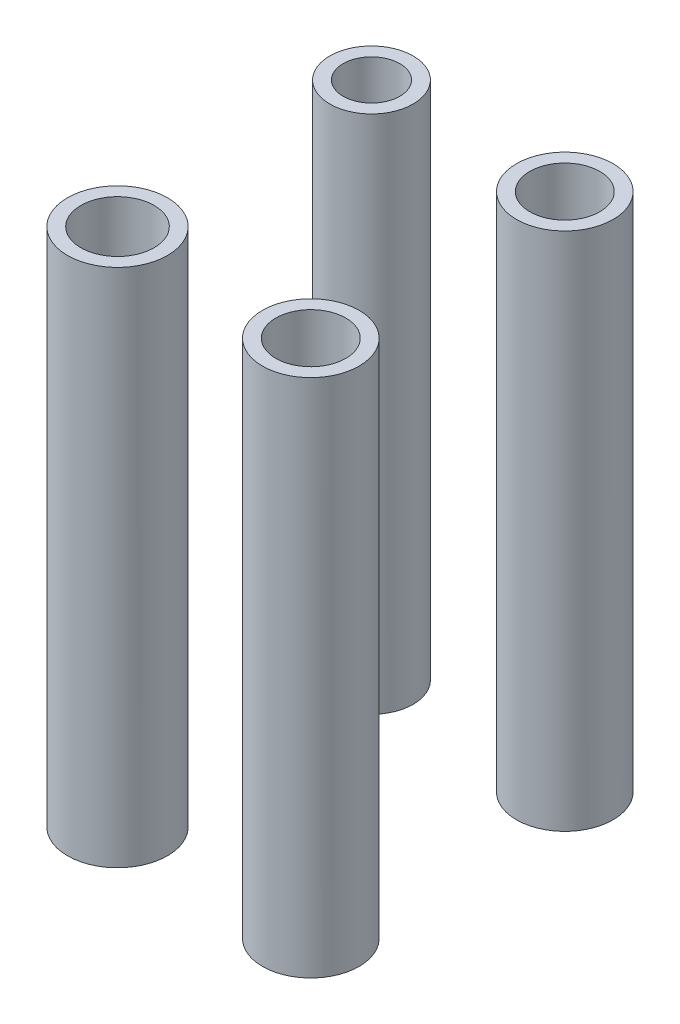
ISO-10303-21;
HEADER;
FILE_DESCRIPTION(('STEP AP214'),'2;1');
FILE_NAME('part.step','',(''),(''),'','','');
FILE_SCHEMA(('AUTOMOTIVE_DESIGN { 1 0 10303 214 1 1 1 1 }'));
ENDSEC;
DATA;
#1=APPLICATION_CONTEXT('core data for automotive mechanical design processes');
#2=APPLICATION_PROTOCOL_DEFINITION('international standard','automotive_design',2000,#1);
#3=PRODUCT_CONTEXT('',#1,'mechanical');
#4=PRODUCT('Part','Part','',(#3));
#5=PRODUCT_RELATED_PRODUCT_CATEGORY('part','',(#4));
#6=PRODUCT_DEFINITION_FORMATION('','',#4);
#7=PRODUCT_DEFINITION_CONTEXT('part definition',#1,'design');
#8=PRODUCT_DEFINITION('design','',#6,#7);
#9=PRODUCT_DEFINITION_SHAPE('','',#8);
#10=(LENGTH_UNIT() NAMED_UNIT(*) SI_UNIT(.MILLI.,.METRE.));
#11=(NAMED_UNIT(*) PLANE_ANGLE_UNIT() SI_UNIT($,.RADIAN.));
#12=(NAMED_UNIT(*) SI_UNIT($,.STERADIAN.) SOLID_ANGLE_UNIT());
#13=UNCERTAINTY_MEASURE_WITH_UNIT(LENGTH_MEASURE(1.E-05),#10,'distance_accuracy_value','');
#14=(GEOMETRIC_REPRESENTATION_CONTEXT(3) GLOBAL_UNCERTAINTY_ASSIGNED_CONTEXT((#13)) GLOBAL_UNIT_ASSIGNED_CONTEXT((#10,
#11,#12)) REPRESENTATION_CONTEXT('',''));
#15=CARTESIAN_POINT('',(0.,0.,0.));
#16=DIRECTION('',(0.,0.,1.));
#17=DIRECTION('',(1.,0.,0.));
#18=AXIS2_PLACEMENT_3D('',#15,#16,#17);
#19=CARTESIAN_POINT('',(-14.5,2.,-17.));
#20=DIRECTION('',(0.,-1.,0.));
#21=DIRECTION('',(0.,0.,-1.));
#22=AXIS2_PLACEMENT_3D('',#19,#20,#21);
#23=CYLINDRICAL_SURFACE('',#22,4.25);
#24=CARTESIAN_POINT('',(-14.5,0.,-17.));
#25=DIRECTION('',(0.,-1.,0.));
#26=DIRECTION('',(0.,0.,-1.));
#27=AXIS2_PLACEMENT_3D('',#24,#25,#26);
#28=CIRCLE('',#27,4.25);
#29=CARTESIAN_POINT('',(-14.5,0.,-21.25));
#30=VERTEX_POINT('',#29);
#31=EDGE_CURVE('E47',#30,#30,#28,.T.);
#32=ORIENTED_EDGE('',*,*,#31,.F.);
#33=EDGE_LOOP('',(#32));
#34=FACE_BOUND('',#33,.T.);
#35=CARTESIAN_POINT('',(-14.5,-78.,-17.));
#36=DIRECTION('',(0.,1.,0.));
#37=DIRECTION('',(0.,0.,1.));
#38=AXIS2_PLACEMENT_3D('',#35,#36,#37);
#39=CIRCLE('',#38,4.25);
#40=CARTESIAN_POINT('',(-14.5,-78.,-12.75));
#41=VERTEX_POINT('',#40);
#42=EDGE_CURVE('E51',#41,#41,#39,.T.);
#43=ORIENTED_EDGE('',*,*,#42,.F.);
#44=EDGE_LOOP('',(#43));
#45=FACE_BOUND('',#44,.T.);
#46=ADVANCED_FACE('F40',(#34,#45),#23,.F.);
#47=CARTESIAN_POINT('',(-14.5,-78.,-17.));
#48=DIRECTION('',(0.,1.,0.));
#49=DIRECTION('',(0.,0.,1.));
#50=AXIS2_PLACEMENT_3D('',#47,#48,#49);
#51=CYLINDRICAL_SURFACE('',#50,6.25);
#52=CARTESIAN_POINT('',(-14.5,-78.,-17.));
#53=DIRECTION('',(0.,1.,0.));
#54=DIRECTION('',(0.,0.,1.));
#55=AXIS2_PLACEMENT_3D('',#52,#53,#54);
#56=CIRCLE('',#55,6.25);
#57=CARTESIAN_POINT('',(-14.5,-78.,-10.75));
#58=VERTEX_POINT('',#57);
#59=EDGE_CURVE('E55',#58,#58,#56,.T.);
#60=ORIENTED_EDGE('',*,*,#59,.T.);
#61=EDGE_LOOP('',(#60));
#62=FACE_BOUND('',#61,.T.);
#63=CARTESIAN_POINT('',(-14.5,0.,-17.));
#64=DIRECTION('',(0.,-1.,0.));
#65=DIRECTION('',(0.,0.,-1.));
#66=AXIS2_PLACEMENT_3D('',#63,#64,#65);
#67=CIRCLE('',#66,6.25);
#68=CARTESIAN_POINT('',(-14.5,0.,-23.25));
#69=VERTEX_POINT('',#68);
#70=EDGE_CURVE('E11',#69,#69,#67,.F.);
#71=ORIENTED_EDGE('',*,*,#70,.F.);
#72=EDGE_LOOP('',(#71));
#73=FACE_BOUND('',#72,.T.);
#74=ADVANCED_FACE('F61',(#62,#73),#51,.T.);
#75=CARTESIAN_POINT('',(-14.5,-78.,-17.));
#76=DIRECTION('',(0.,1.,0.));
#77=DIRECTION('',(0.,0.,1.));
#78=AXIS2_PLACEMENT_3D('',#75,#76,#77);
#79=PLANE('',#78);
#80=ORIENTED_EDGE('',*,*,#42,.T.);
#81=EDGE_LOOP('',(#80));
#82=FACE_BOUND('',#81,.T.);
#83=ORIENTED_EDGE('',*,*,#59,.F.);
#84=EDGE_LOOP('',(#83));
#85=FACE_BOUND('',#84,.T.);
#86=ADVANCED_FACE('F64',(#82,#85),#79,.F.);
#87=CARTESIAN_POINT('',(24.5,0.,41.));
#88=DIRECTION('',(0.,-1.,0.));
#89=DIRECTION('',(0.,0.,-1.));
#90=AXIS2_PLACEMENT_3D('',#87,#88,#89);
#91=PLANE('',#90);
#92=ORIENTED_EDGE('',*,*,#31,.T.);
#93=EDGE_LOOP('',(#92));
#94=FACE_BOUND('',#93,.T.);
#95=ORIENTED_EDGE('',*,*,#70,.T.);
#96=EDGE_LOOP('',(#95));
#97=FACE_BOUND('',#96,.T.);
#98=ADVANCED_FACE('F42',(#94,#97),#91,.F.);
#99=CLOSED_SHELL('',(#46,#74,#86,#98));
#100=MANIFOLD_SOLID_BREP('B2',#99);
#101=CARTESIAN_POINT('',(14.5,2.,21.1));
#102=DIRECTION('',(0.,-1.,0.));
#103=DIRECTION('',(0.,0.,-1.));
#104=AXIS2_PLACEMENT_3D('',#101,#102,#103);
#105=CYLINDRICAL_SURFACE('',#104,5.25);
#106=CARTESIAN_POINT('',(14.5,0.,21.1));
#107=DIRECTION('',(0.,-1.,0.));
#108=DIRECTION('',(0.,0.,-1.));
#109=AXIS2_PLACEMENT_3D('',#106,#107,#108);
#110=CIRCLE('',#109,5.25);
#111=CARTESIAN_POINT('',(14.5,0.,15.85));
#112=VERTEX_POINT('',#111);
#113=EDGE_CURVE('E120',#112,#112,#110,.T.);
#114=ORIENTED_EDGE('',*,*,#113,.F.);
#115=EDGE_LOOP('',(#114));
#116=FACE_BOUND('',#115,.T.);
#117=CARTESIAN_POINT('',(14.5,-78.,21.1));
#118=DIRECTION('',(0.,1.,0.));
#119=DIRECTION('',(0.,0.,1.));
#120=AXIS2_PLACEMENT_3D('',#117,#118,#119);
#121=CIRCLE('',#120,5.25);
#122=CARTESIAN_POINT('',(14.5,-78.,26.35));
#123=VERTEX_POINT('',#122);
#124=EDGE_CURVE('E128',#123,#123,#121,.T.);
#125=ORIENTED_EDGE('',*,*,#124,.F.);
#126=EDGE_LOOP('',(#125));
#127=FACE_BOUND('',#126,.T.);
#128=ADVANCED_FACE('F113',(#116,#127),#105,.F.);
#129=CARTESIAN_POINT('',(14.5,-78.,21.1));
#130=DIRECTION('',(0.,1.,0.));
#131=DIRECTION('',(0.,0.,1.));
#132=AXIS2_PLACEMENT_3D('',#129,#130,#131);
#133=PLANE('',#132);
#134=ORIENTED_EDGE('',*,*,#124,.T.);
#135=EDGE_LOOP('',(#134));
#136=FACE_BOUND('',#135,.T.);
#137=CARTESIAN_POINT('',(14.5,-78.,21.1));
#138=DIRECTION('',(0.,1.,0.));
#139=DIRECTION('',(0.,0.,1.));
#140=AXIS2_PLACEMENT_3D('',#137,#138,#139);
#141=CIRCLE('',#140,7.25);
#142=CARTESIAN_POINT('',(14.5,-78.,28.35));
#143=VERTEX_POINT('',#142);
#144=EDGE_CURVE('E124',#143,#143,#141,.T.);
#145=ORIENTED_EDGE('',*,*,#144,.F.);
#146=EDGE_LOOP('',(#145));
#147=FACE_BOUND('',#146,.T.);
#148=ADVANCED_FACE('F134',(#136,#147),#133,.F.);
#149=CARTESIAN_POINT('',(14.5,-78.,21.1));
#150=DIRECTION('',(0.,1.,0.));
#151=DIRECTION('',(0.,0.,1.));
#152=AXIS2_PLACEMENT_3D('',#149,#150,#151);
#153=CYLINDRICAL_SURFACE('',#152,7.25);
#154=ORIENTED_EDGE('',*,*,#144,.T.);
#155=EDGE_LOOP('',(#154));
#156=FACE_BOUND('',#155,.T.);
#157=CARTESIAN_POINT('',(14.5,0.,21.1));
#158=DIRECTION('',(0.,-1.,0.));
#159=DIRECTION('',(0.,0.,-1.));
#160=AXIS2_PLACEMENT_3D('',#157,#158,#159);
#161=CIRCLE('',#160,7.25);
#162=CARTESIAN_POINT('',(14.5,0.,13.85));
#163=VERTEX_POINT('',#162);
#164=EDGE_CURVE('E39',#163,#163,#161,.F.);
#165=ORIENTED_EDGE('',*,*,#164,.F.);
#166=EDGE_LOOP('',(#165));
#167=FACE_BOUND('',#166,.T.);
#168=ADVANCED_FACE('F143',(#156,#167),#153,.T.);
#169=CARTESIAN_POINT('',(24.5,0.,41.));
#170=DIRECTION('',(0.,-1.,0.));
#171=DIRECTION('',(0.,0.,-1.));
#172=AXIS2_PLACEMENT_3D('',#169,#170,#171);
#173=PLANE('',#172);
#174=ORIENTED_EDGE('',*,*,#113,.T.);
#175=EDGE_LOOP('',(#174));
#176=FACE_BOUND('',#175,.T.);
#177=ORIENTED_EDGE('',*,*,#164,.T.);
#178=EDGE_LOOP('',(#177));
#179=FACE_BOUND('',#178,.T.);
#180=ADVANCED_FACE('F115',(#176,#179),#173,.F.);
#181=CLOSED_SHELL('',(#128,#148,#168,#180));
#182=MANIFOLD_SOLID_BREP('B6',#181);
#183=CARTESIAN_POINT('',(-14.5,2.,21.1));
#184=DIRECTION('',(0.,-1.,0.));
#185=DIRECTION('',(0.,0.,-1.));
#186=AXIS2_PLACEMENT_3D('',#183,#184,#185);
#187=CYLINDRICAL_SURFACE('',#186,5.5);
#188=CARTESIAN_POINT('',(-14.5,0.,21.1));
#189=DIRECTION('',(0.,-1.,0.));
#190=DIRECTION('',(0.,0.,-1.));
#191=AXIS2_PLACEMENT_3D('',#188,#189,#190);
#192=CIRCLE('',#191,5.5);
#193=CARTESIAN_POINT('',(-14.5,0.,15.6));
#194=VERTEX_POINT('',#193);
#195=EDGE_CURVE('E192',#194,#194,#192,.T.);
#196=ORIENTED_EDGE('',*,*,#195,.F.);
#197=EDGE_LOOP('',(#196));
#198=FACE_BOUND('',#197,.T.);
#199=CARTESIAN_POINT('',(-14.5,-78.,21.1));
#200=DIRECTION('',(0.,1.,0.));
#201=DIRECTION('',(0.,0.,1.));
#202=AXIS2_PLACEMENT_3D('',#199,#200,#201);
#203=CIRCLE('',#202,5.5);
#204=CARTESIAN_POINT('',(-14.5,-78.,26.6));
#205=VERTEX_POINT('',#204);
#206=EDGE_CURVE('E200',#205,#205,#203,.T.);
#207=ORIENTED_EDGE('',*,*,#206,.F.);
#208=EDGE_LOOP('',(#207));
#209=FACE_BOUND('',#208,.T.);
#210=ADVANCED_FACE('F185',(#198,#209),#187,.F.);
#211=CARTESIAN_POINT('',(-14.5,-78.,21.1));
#212=DIRECTION('',(0.,1.,0.));
#213=DIRECTION('',(0.,0.,1.));
#214=AXIS2_PLACEMENT_3D('',#211,#212,#213);
#215=PLANE('',#214);
#216=ORIENTED_EDGE('',*,*,#206,.T.);
#217=EDGE_LOOP('',(#216));
#218=FACE_BOUND('',#217,.T.);
#219=CARTESIAN_POINT('',(-14.5,-78.,21.1));
#220=DIRECTION('',(0.,1.,0.));
#221=DIRECTION('',(0.,0.,1.));
#222=AXIS2_PLACEMENT_3D('',#219,#220,#221);
#223=CIRCLE('',#222,7.5);
#224=CARTESIAN_POINT('',(-14.5,-78.,28.6));
#225=VERTEX_POINT('',#224);
#226=EDGE_CURVE('E196',#225,#225,#223,.T.);
#227=ORIENTED_EDGE('',*,*,#226,.F.);
#228=EDGE_LOOP('',(#227));
#229=FACE_BOUND('',#228,.T.);
#230=ADVANCED_FACE('F206',(#218,#229),#215,.F.);
#231=CARTESIAN_POINT('',(-14.5,-78.,21.1));
#232=DIRECTION('',(0.,1.,0.));
#233=DIRECTION('',(0.,0.,1.));
#234=AXIS2_PLACEMENT_3D('',#231,#232,#233);
#235=CYLINDRICAL_SURFACE('',#234,7.5);
#236=ORIENTED_EDGE('',*,*,#226,.T.);
#237=EDGE_LOOP('',(#236));
#238=FACE_BOUND('',#237,.T.);
#239=CARTESIAN_POINT('',(-14.5,0.,21.1));
#240=DIRECTION('',(0.,-1.,0.));
#241=DIRECTION('',(0.,0.,-1.));
#242=AXIS2_PLACEMENT_3D('',#239,#240,#241);
#243=CIRCLE('',#242,7.5);
#244=CARTESIAN_POINT('',(-14.5,0.,13.6));
#245=VERTEX_POINT('',#244);
#246=EDGE_CURVE('E112',#245,#245,#243,.F.);
#247=ORIENTED_EDGE('',*,*,#246,.F.);
#248=EDGE_LOOP('',(#247));
#249=FACE_BOUND('',#248,.T.);
#250=ADVANCED_FACE('F215',(#238,#249),#235,.T.);
#251=CARTESIAN_POINT('',(24.5,0.,41.));
#252=DIRECTION('',(0.,-1.,0.));
#253=DIRECTION('',(0.,0.,-1.));
#254=AXIS2_PLACEMENT_3D('',#251,#252,#253);
#255=PLANE('',#254);
#256=ORIENTED_EDGE('',*,*,#195,.T.);
#257=EDGE_LOOP('',(#256));
#258=FACE_BOUND('',#257,.T.);
#259=ORIENTED_EDGE('',*,*,#246,.T.);
#260=EDGE_LOOP('',(#259));
#261=FACE_BOUND('',#260,.T.);
#262=ADVANCED_FACE('F187',(#258,#261),#255,.F.);
#263=CLOSED_SHELL('',(#210,#230,#250,#262));
#264=MANIFOLD_SOLID_BREP('B34',#263);
#265=CARTESIAN_POINT('',(14.5,2.,-17.));
#266=DIRECTION('',(0.,-1.,0.));
#267=DIRECTION('',(0.,0.,-1.));
#268=AXIS2_PLACEMENT_3D('',#265,#266,#267);
#269=CYLINDRICAL_SURFACE('',#268,5.25);
#270=CARTESIAN_POINT('',(14.5,0.,-17.));
#271=DIRECTION('',(0.,-1.,0.));
#272=DIRECTION('',(0.,0.,-1.));
#273=AXIS2_PLACEMENT_3D('',#270,#271,#272);
#274=CIRCLE('',#273,5.25);
#275=CARTESIAN_POINT('',(14.5,0.,-22.25));
#276=VERTEX_POINT('',#275);
#277=EDGE_CURVE('E260',#276,#276,#274,.T.);
#278=ORIENTED_EDGE('',*,*,#277,.F.);
#279=EDGE_LOOP('',(#278));
#280=FACE_BOUND('',#279,.T.);
#281=CARTESIAN_POINT('',(14.5,-78.,-17.));
#282=DIRECTION('',(0.,1.,0.));
#283=DIRECTION('',(0.,0.,1.));
#284=AXIS2_PLACEMENT_3D('',#281,#282,#283);
#285=CIRCLE('',#284,5.25);
#286=CARTESIAN_POINT('',(14.5,-78.,-11.75));
#287=VERTEX_POINT('',#286);
#288=EDGE_CURVE('E256',#287,#287,#285,.T.);
#289=ORIENTED_EDGE('',*,*,#288,.F.);
#290=EDGE_LOOP('',(#289));
#291=FACE_BOUND('',#290,.T.);
#292=ADVANCED_FACE('F250',(#280,#291),#269,.F.);
#293=CARTESIAN_POINT('',(14.5,-78.,-17.));
#294=DIRECTION('',(0.,1.,0.));
#295=DIRECTION('',(0.,0.,1.));
#296=AXIS2_PLACEMENT_3D('',#293,#294,#295);
#297=PLANE('',#296);
#298=ORIENTED_EDGE('',*,*,#288,.T.);
#299=EDGE_LOOP('',(#298));
#300=FACE_BOUND('',#299,.T.);
#301=CARTESIAN_POINT('',(14.5,-78.,-17.));
#302=DIRECTION('',(0.,1.,0.));
#303=DIRECTION('',(0.,0.,1.));
#304=AXIS2_PLACEMENT_3D('',#301,#302,#303);
#305=CIRCLE('',#304,7.25);
#306=CARTESIAN_POINT('',(14.5,-78.,-9.74999999999997));
#307=VERTEX_POINT('',#306);
#308=EDGE_CURVE('E184',#307,#307,#305,.T.);
#309=ORIENTED_EDGE('',*,*,#308,.F.);
#310=EDGE_LOOP('',(#309));
#311=FACE_BOUND('',#310,.T.);
#312=ADVANCED_FACE('F274',(#300,#311),#297,.F.);
#313=CARTESIAN_POINT('',(14.5,-78.,-17.));
#314=DIRECTION('',(0.,1.,0.));
#315=DIRECTION('',(0.,0.,1.));
#316=AXIS2_PLACEMENT_3D('',#313,#314,#315);
#317=CYLINDRICAL_SURFACE('',#316,7.25);
#318=ORIENTED_EDGE('',*,*,#308,.T.);
#319=EDGE_LOOP('',(#318));
#320=FACE_BOUND('',#319,.T.);
#321=CARTESIAN_POINT('',(14.5,0.,-17.));
#322=DIRECTION('',(0.,-1.,0.));
#323=DIRECTION('',(0.,0.,-1.));
#324=AXIS2_PLACEMENT_3D('',#321,#322,#323);
#325=CIRCLE('',#324,7.25);
#326=CARTESIAN_POINT('',(14.5,0.,-24.25));
#327=VERTEX_POINT('',#326);
#328=EDGE_CURVE('E264',#327,#327,#325,.F.);
#329=ORIENTED_EDGE('',*,*,#328,.F.);
#330=EDGE_LOOP('',(#329));
#331=FACE_BOUND('',#330,.T.);
#332=ADVANCED_FACE('F272',(#320,#331),#317,.T.);
#333=CARTESIAN_POINT('',(24.5,0.,41.));
#334=DIRECTION('',(0.,-1.,0.));
#335=DIRECTION('',(0.,0.,-1.));
#336=AXIS2_PLACEMENT_3D('',#333,#334,#335);
#337=PLANE('',#336);
#338=ORIENTED_EDGE('',*,*,#277,.T.);
#339=EDGE_LOOP('',(#338));
#340=FACE_BOUND('',#339,.T.);
#341=ORIENTED_EDGE('',*,*,#328,.T.);
#342=EDGE_LOOP('',(#341));
#343=FACE_BOUND('',#342,.T.);
#344=ADVANCED_FACE('F270',(#340,#343),#337,.F.);
#345=CLOSED_SHELL('',(#292,#312,#332,#344));
#346=MANIFOLD_SOLID_BREP('B107',#345);
#347=ADVANCED_BREP_SHAPE_REPRESENTATION('',(#18,#100,#182,#264,#346),#14);
#348=SHAPE_DEFINITION_REPRESENTATION(#9,#347);
ENDSEC;
END-ISO-10303-21;
